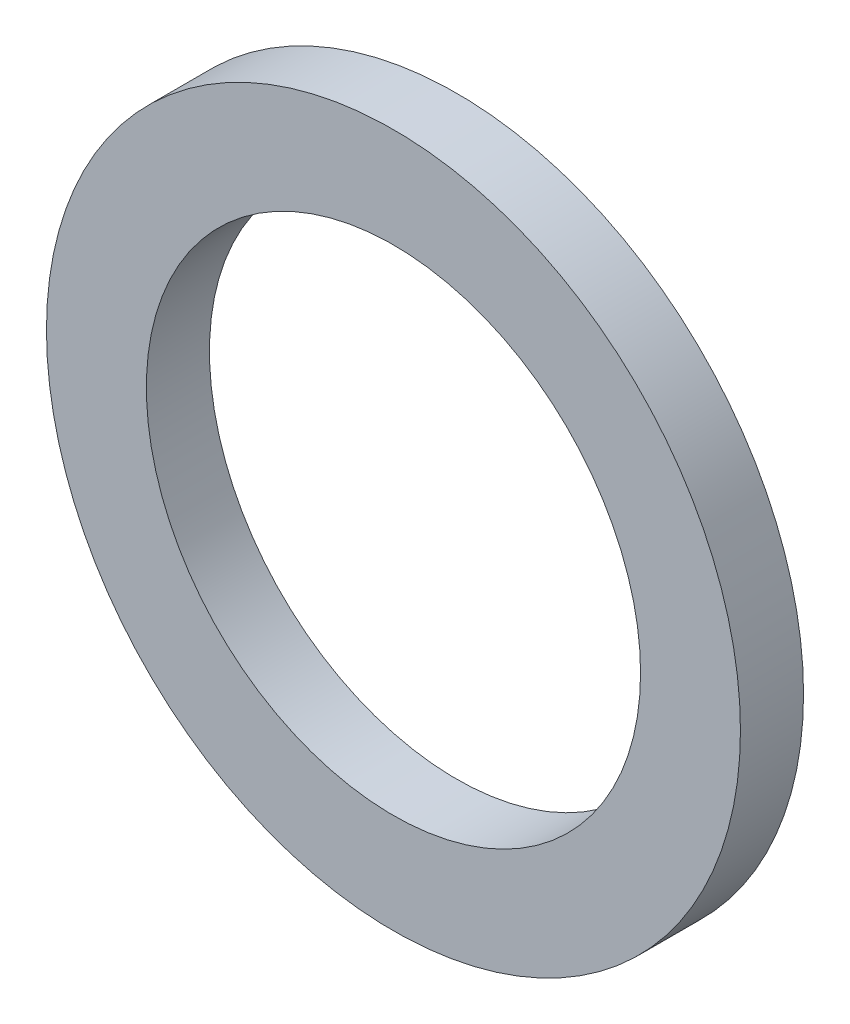
ISO-10303-21;
HEADER;
FILE_DESCRIPTION(('STEP AP214'),'2;1');
FILE_NAME('part.step','',(''),(''),'','','');
FILE_SCHEMA(('AUTOMOTIVE_DESIGN { 1 0 10303 214 1 1 1 1 }'));
ENDSEC;
DATA;
#1=APPLICATION_CONTEXT('core data for automotive mechanical design processes');
#2=APPLICATION_PROTOCOL_DEFINITION('international standard','automotive_design',2000,#1);
#3=PRODUCT_CONTEXT('',#1,'mechanical');
#4=PRODUCT('Part','Part','',(#3));
#5=PRODUCT_RELATED_PRODUCT_CATEGORY('part','',(#4));
#6=PRODUCT_DEFINITION_FORMATION('','',#4);
#7=PRODUCT_DEFINITION_CONTEXT('part definition',#1,'design');
#8=PRODUCT_DEFINITION('design','',#6,#7);
#9=PRODUCT_DEFINITION_SHAPE('','',#8);
#10=(LENGTH_UNIT() NAMED_UNIT(*) SI_UNIT(.MILLI.,.METRE.));
#11=(NAMED_UNIT(*) PLANE_ANGLE_UNIT() SI_UNIT($,.RADIAN.));
#12=(NAMED_UNIT(*) SI_UNIT($,.STERADIAN.) SOLID_ANGLE_UNIT());
#13=UNCERTAINTY_MEASURE_WITH_UNIT(LENGTH_MEASURE(1.E-05),#10,'distance_accuracy_value','');
#14=(GEOMETRIC_REPRESENTATION_CONTEXT(3) GLOBAL_UNCERTAINTY_ASSIGNED_CONTEXT((#13)) GLOBAL_UNIT_ASSIGNED_CONTEXT((#10,
#11,#12)) REPRESENTATION_CONTEXT('',''));
#15=CARTESIAN_POINT('',(0.,0.,0.));
#16=DIRECTION('',(0.,0.,1.));
#17=DIRECTION('',(1.,0.,0.));
#18=AXIS2_PLACEMENT_3D('',#15,#16,#17);
#19=CARTESIAN_POINT('',(0.,0.,1.524));
#20=DIRECTION('',(0.,0.,1.));
#21=DIRECTION('',(1.,0.,0.));
#22=AXIS2_PLACEMENT_3D('',#19,#20,#21);
#23=PLANE('',#22);
#24=CARTESIAN_POINT('',(0.,0.,1.524));
#25=DIRECTION('',(0.,0.,1.));
#26=DIRECTION('',(1.,0.,0.));
#27=AXIS2_PLACEMENT_3D('',#24,#25,#26);
#28=CIRCLE('',#27,8.382);
#29=CARTESIAN_POINT('',(8.382,0.,1.524));
#30=VERTEX_POINT('',#29);
#31=EDGE_CURVE('E10',#30,#30,#28,.T.);
#32=ORIENTED_EDGE('',*,*,#31,.T.);
#33=EDGE_LOOP('',(#32));
#34=FACE_BOUND('',#33,.T.);
#35=CARTESIAN_POINT('',(0.,0.,1.524));
#36=DIRECTION('',(0.,0.,1.));
#37=DIRECTION('',(1.,0.,0.));
#38=AXIS2_PLACEMENT_3D('',#35,#36,#37);
#39=CIRCLE('',#38,5.969);
#40=CARTESIAN_POINT('',(5.969,0.,1.524));
#41=VERTEX_POINT('',#40);
#42=EDGE_CURVE('E52',#41,#41,#39,.T.);
#43=ORIENTED_EDGE('',*,*,#42,.F.);
#44=EDGE_LOOP('',(#43));
#45=FACE_BOUND('',#44,.T.);
#46=ADVANCED_FACE('F41',(#34,#45),#23,.T.);
#47=CARTESIAN_POINT('',(0.,0.,0.));
#48=DIRECTION('',(0.,0.,1.));
#49=DIRECTION('',(1.,0.,0.));
#50=AXIS2_PLACEMENT_3D('',#47,#48,#49);
#51=PLANE('',#50);
#52=CARTESIAN_POINT('',(0.,0.,0.));
#53=DIRECTION('',(0.,0.,1.));
#54=DIRECTION('',(1.,0.,0.));
#55=AXIS2_PLACEMENT_3D('',#52,#53,#54);
#56=CIRCLE('',#55,8.382);
#57=CARTESIAN_POINT('',(8.382,0.,0.));
#58=VERTEX_POINT('',#57);
#59=EDGE_CURVE('E45',#58,#58,#56,.T.);
#60=ORIENTED_EDGE('',*,*,#59,.F.);
#61=EDGE_LOOP('',(#60));
#62=FACE_BOUND('',#61,.T.);
#63=CARTESIAN_POINT('',(0.,0.,0.));
#64=DIRECTION('',(0.,0.,1.));
#65=DIRECTION('',(1.,0.,0.));
#66=AXIS2_PLACEMENT_3D('',#63,#64,#65);
#67=CIRCLE('',#66,5.969);
#68=CARTESIAN_POINT('',(5.969,0.,0.));
#69=VERTEX_POINT('',#68);
#70=EDGE_CURVE('E54',#69,#69,#67,.T.);
#71=ORIENTED_EDGE('',*,*,#70,.T.);
#72=EDGE_LOOP('',(#71));
#73=FACE_BOUND('',#72,.T.);
#74=ADVANCED_FACE('F64',(#62,#73),#51,.F.);
#75=CARTESIAN_POINT('',(0.,0.,1.524));
#76=DIRECTION('',(0.,0.,-1.));
#77=DIRECTION('',(-1.,0.,0.));
#78=AXIS2_PLACEMENT_3D('',#75,#76,#77);
#79=CYLINDRICAL_SURFACE('',#78,8.382);
#80=ORIENTED_EDGE('',*,*,#31,.F.);
#81=EDGE_LOOP('',(#80));
#82=FACE_BOUND('',#81,.T.);
#83=ORIENTED_EDGE('',*,*,#59,.T.);
#84=EDGE_LOOP('',(#83));
#85=FACE_BOUND('',#84,.T.);
#86=ADVANCED_FACE('F43',(#82,#85),#79,.T.);
#87=CARTESIAN_POINT('',(0.,0.,1.524));
#88=DIRECTION('',(0.,0.,-1.));
#89=DIRECTION('',(-1.,0.,0.));
#90=AXIS2_PLACEMENT_3D('',#87,#88,#89);
#91=CYLINDRICAL_SURFACE('',#90,5.969);
#92=ORIENTED_EDGE('',*,*,#42,.T.);
#93=EDGE_LOOP('',(#92));
#94=FACE_BOUND('',#93,.T.);
#95=ORIENTED_EDGE('',*,*,#70,.F.);
#96=EDGE_LOOP('',(#95));
#97=FACE_BOUND('',#96,.T.);
#98=ADVANCED_FACE('F60',(#94,#97),#91,.F.);
#99=CLOSED_SHELL('',(#46,#74,#86,#98));
#100=MANIFOLD_SOLID_BREP('B2',#99);
#101=ADVANCED_BREP_SHAPE_REPRESENTATION('',(#18,#100),#14);
#102=SHAPE_DEFINITION_REPRESENTATION(#9,#101);
ENDSEC;
END-ISO-10303-21;
